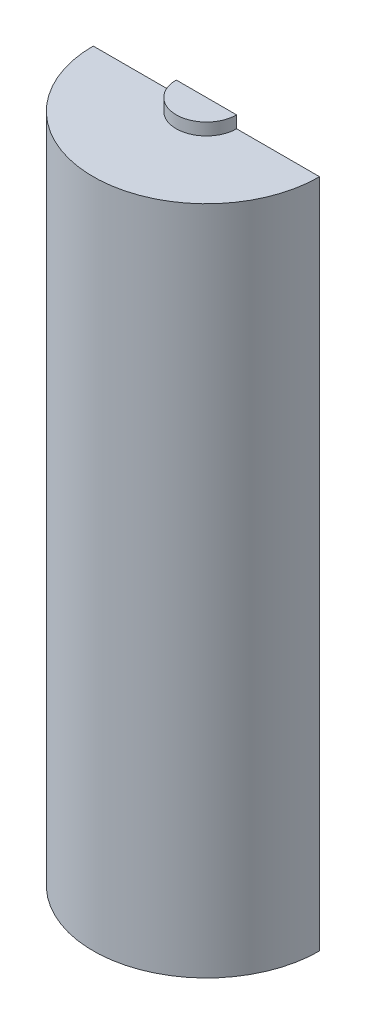
ISO-10303-21;
HEADER;
FILE_DESCRIPTION(('STEP AP214'),'2;1');
FILE_NAME('part.step','',(''),(''),'','','');
FILE_SCHEMA(('AUTOMOTIVE_DESIGN { 1 0 10303 214 1 1 1 1 }'));
ENDSEC;
DATA;
#1=APPLICATION_CONTEXT('core data for automotive mechanical design processes');
#2=APPLICATION_PROTOCOL_DEFINITION('international standard','automotive_design',2000,#1);
#3=PRODUCT_CONTEXT('',#1,'mechanical');
#4=PRODUCT('Part','Part','',(#3));
#5=PRODUCT_RELATED_PRODUCT_CATEGORY('part','',(#4));
#6=PRODUCT_DEFINITION_FORMATION('','',#4);
#7=PRODUCT_DEFINITION_CONTEXT('part definition',#1,'design');
#8=PRODUCT_DEFINITION('design','',#6,#7);
#9=PRODUCT_DEFINITION_SHAPE('','',#8);
#10=(LENGTH_UNIT() NAMED_UNIT(*) SI_UNIT(.MILLI.,.METRE.));
#11=(NAMED_UNIT(*) PLANE_ANGLE_UNIT() SI_UNIT($,.RADIAN.));
#12=(NAMED_UNIT(*) SI_UNIT($,.STERADIAN.) SOLID_ANGLE_UNIT());
#13=UNCERTAINTY_MEASURE_WITH_UNIT(LENGTH_MEASURE(1.E-05),#10,'distance_accuracy_value','');
#14=(GEOMETRIC_REPRESENTATION_CONTEXT(3) GLOBAL_UNCERTAINTY_ASSIGNED_CONTEXT((#13)) GLOBAL_UNIT_ASSIGNED_CONTEXT((#10,
#11,#12)) REPRESENTATION_CONTEXT('',''));
#15=CARTESIAN_POINT('',(0.,0.,0.));
#16=DIRECTION('',(0.,0.,1.));
#17=DIRECTION('',(1.,0.,0.));
#18=AXIS2_PLACEMENT_3D('',#15,#16,#17);
#19=CARTESIAN_POINT('',(0.,82.5881,0.));
#20=DIRECTION('',(0.,-1.,0.));
#21=DIRECTION('',(0.,0.,-1.));
#22=AXIS2_PLACEMENT_3D('',#19,#20,#21);
#23=CYLINDRICAL_SURFACE('',#22,12.2555);
#24=CARTESIAN_POINT('',(0.,67.8053,0.));
#25=DIRECTION('',(0.,-1.,0.));
#26=DIRECTION('',(-0.345087120666617,0.,0.938570657516004));
#27=AXIS2_PLACEMENT_3D('',#24,#25,#26);
#28=CIRCLE('',#27,12.2555);
#29=CARTESIAN_POINT('',(-2.96190447417867,67.8053,11.8921992135955));
#30=VERTEX_POINT('',#29);
#31=CARTESIAN_POINT('',(-4.22921520732972,67.8053,11.5026526931874));
#32=VERTEX_POINT('',#31);
#33=EDGE_CURVE('E278',#30,#32,#28,.T.);
#34=ORIENTED_EDGE('',*,*,#33,.F.);
#35=DIRECTION('',(0.,-1.,0.));
#36=VECTOR('',#35,1.);
#37=CARTESIAN_POINT('',(-2.96190447417867,71.6153,11.8921992135955));
#38=LINE('',#37,#36);
#39=CARTESIAN_POINT('',(-2.96190447417868,75.4253,11.8921992135955));
#40=VERTEX_POINT('',#39);
#41=EDGE_CURVE('E292',#30,#40,#38,.F.);
#42=ORIENTED_EDGE('',*,*,#41,.T.);
#43=CARTESIAN_POINT('',(0.,75.4253,0.));
#44=DIRECTION('',(0.,-1.,0.));
#45=DIRECTION('',(-0.364463857704521,0.,0.931217534428524));
#46=AXIS2_PLACEMENT_3D('',#43,#44,#45);
#47=CIRCLE('',#46,12.2555);
#48=CARTESIAN_POINT('',(-4.46668680809776,75.4253,11.4125364931888));
#49=VERTEX_POINT('',#48);
#50=EDGE_CURVE('E254',#40,#49,#47,.T.);
#51=ORIENTED_EDGE('',*,*,#50,.T.);
#52=DIRECTION('',(0.,-1.,0.));
#53=VECTOR('',#52,1.);
#54=CARTESIAN_POINT('',(-4.46668680809777,75.4253,11.4125364931888));
#55=LINE('',#54,#53);
#56=CARTESIAN_POINT('',(-4.46668680809777,71.3105,11.4125364931888));
#57=VERTEX_POINT('',#56);
#58=EDGE_CURVE('E258',#49,#57,#55,.T.);
#59=ORIENTED_EDGE('',*,*,#58,.T.);
#60=CARTESIAN_POINT('',(-4.22921520732972,67.8053,11.5026526931874));
#61=CARTESIAN_POINT('',(-4.30868085633509,68.9737000000346,11.4734353169701));
#62=CARTESIAN_POINT('',(-4.38784372351382,70.1420999999654,11.443394433142));
#63=CARTESIAN_POINT('',(-4.46668680809776,71.3105,11.4125364931888));
#64=B_SPLINE_CURVE_WITH_KNOTS('',3,(#60,#61,#62,#63),.UNSPECIFIED.,.F.,.F.,(4,4),(0.,1.),.UNSPECIFIED.);
#65=EDGE_CURVE('E282',#57,#32,#64,.F.);
#66=ORIENTED_EDGE('',*,*,#65,.T.);
#67=EDGE_LOOP('',(#34,#42,#51,#59,#66));
#68=FACE_BOUND('',#67,.T.);
#69=DIRECTION('',(0.,1.,0.));
#70=VECTOR('',#69,1.);
#71=CARTESIAN_POINT('',(4.46668680809776,71.3105,11.4125364931888));
#72=LINE('',#71,#70);
#73=CARTESIAN_POINT('',(4.46668680809776,71.3105,11.4125364931888));
#74=VERTEX_POINT('',#73);
#75=CARTESIAN_POINT('',(4.46668680809776,75.4253,11.4125364931888));
#76=VERTEX_POINT('',#75);
#77=EDGE_CURVE('E424',#74,#76,#72,.T.);
#78=ORIENTED_EDGE('',*,*,#77,.T.);
#79=CARTESIAN_POINT('',(0.,75.4253,0.));
#80=DIRECTION('',(0.,-1.,0.));
#81=DIRECTION('',(0.226009547016077,0.,0.974125086761237));
#82=AXIS2_PLACEMENT_3D('',#79,#80,#81);
#83=CIRCLE('',#82,12.2555);
#84=CARTESIAN_POINT('',(2.96190447417868,75.4253,11.8921992135955));
#85=VERTEX_POINT('',#84);
#86=EDGE_CURVE('E433',#76,#85,#83,.T.);
#87=ORIENTED_EDGE('',*,*,#86,.T.);
#88=DIRECTION('',(0.,-1.,0.));
#89=VECTOR('',#88,1.);
#90=CARTESIAN_POINT('',(2.96190447417868,71.6153,11.8921992135955));
#91=LINE('',#90,#89);
#92=CARTESIAN_POINT('',(2.96190447417868,67.8053,11.8921992135955));
#93=VERTEX_POINT('',#92);
#94=EDGE_CURVE('E294',#85,#93,#91,.T.);
#95=ORIENTED_EDGE('',*,*,#94,.T.);
#96=CARTESIAN_POINT('',(0.,67.8053,0.));
#97=DIRECTION('',(0.,-1.,0.));
#98=DIRECTION('',(0.226009547016077,0.,0.974125086761237));
#99=AXIS2_PLACEMENT_3D('',#96,#97,#98);
#100=CIRCLE('',#99,12.2555);
#101=CARTESIAN_POINT('',(4.22921520732972,67.8053,11.5026526931874));
#102=VERTEX_POINT('',#101);
#103=EDGE_CURVE('E426',#102,#93,#100,.T.);
#104=ORIENTED_EDGE('',*,*,#103,.F.);
#105=CARTESIAN_POINT('',(4.46668680809776,71.3105,11.4125364931888));
#106=CARTESIAN_POINT('',(4.38784372351381,70.1420999999654,11.443394433142));
#107=CARTESIAN_POINT('',(4.30868085633509,68.9737000000346,11.4734353169701));
#108=CARTESIAN_POINT('',(4.22921520732971,67.8053,11.5026526931874));
#109=B_SPLINE_CURVE_WITH_KNOTS('',3,(#105,#106,#107,#108),.UNSPECIFIED.,.F.,.F.,(4,4),(0.,1.),.UNSPECIFIED.);
#110=EDGE_CURVE('E408',#102,#74,#109,.F.);
#111=ORIENTED_EDGE('',*,*,#110,.T.);
#112=EDGE_LOOP('',(#78,#87,#95,#104,#111));
#113=FACE_BOUND('',#112,.T.);
#114=CARTESIAN_POINT('',(0.,0.,0.));
#115=DIRECTION('',(0.,-1.,0.));
#116=DIRECTION('',(0.,0.,1.));
#117=AXIS2_PLACEMENT_3D('',#114,#115,#116);
#118=CIRCLE('',#117,12.2555);
#119=CARTESIAN_POINT('',(12.2555,0.,0.));
#120=VERTEX_POINT('',#119);
#121=CARTESIAN_POINT('',(-12.2555,0.,0.));
#122=VERTEX_POINT('',#121);
#123=EDGE_CURVE('E448',#120,#122,#118,.T.);
#124=ORIENTED_EDGE('',*,*,#123,.T.);
#125=DIRECTION('',(0.,-1.,0.));
#126=VECTOR('',#125,1.);
#127=CARTESIAN_POINT('',(-12.2555,82.5881,0.));
#128=LINE('',#127,#126);
#129=CARTESIAN_POINT('',(-12.2555,82.5881,0.));
#130=VERTEX_POINT('',#129);
#131=EDGE_CURVE('E575',#130,#122,#128,.T.);
#132=ORIENTED_EDGE('',*,*,#131,.F.);
#133=CARTESIAN_POINT('',(0.,82.5881,0.));
#134=DIRECTION('',(0.,-1.,0.));
#135=DIRECTION('',(0.,0.,1.));
#136=AXIS2_PLACEMENT_3D('',#133,#134,#135);
#137=CIRCLE('',#136,12.2555);
#138=CARTESIAN_POINT('',(12.2555,82.5881,0.));
#139=VERTEX_POINT('',#138);
#140=EDGE_CURVE('E590',#139,#130,#137,.T.);
#141=ORIENTED_EDGE('',*,*,#140,.F.);
#142=DIRECTION('',(0.,-1.,0.));
#143=VECTOR('',#142,1.);
#144=CARTESIAN_POINT('',(12.2555,82.5881,0.));
#145=LINE('',#144,#143);
#146=EDGE_CURVE('E587',#139,#120,#145,.T.);
#147=ORIENTED_EDGE('',*,*,#146,.T.);
#148=EDGE_LOOP('',(#124,#132,#141,#147));
#149=FACE_BOUND('',#148,.T.);
#150=ADVANCED_FACE('F73',(#68,#113,#149),#23,.F.);
#151=CARTESIAN_POINT('',(0.,82.5881,0.));
#152=DIRECTION('',(0.,-1.,0.));
#153=DIRECTION('',(0.,0.,-1.));
#154=AXIS2_PLACEMENT_3D('',#151,#152,#153);
#155=CYLINDRICAL_SURFACE('',#154,14.2875);
#156=CARTESIAN_POINT('',(0.,0.,0.));
#157=DIRECTION('',(0.,1.,0.));
#158=DIRECTION('',(0.,0.,1.));
#159=AXIS2_PLACEMENT_3D('',#156,#157,#158);
#160=CIRCLE('',#159,14.2875);
#161=CARTESIAN_POINT('',(-14.2875,0.,0.));
#162=VERTEX_POINT('',#161);
#163=CARTESIAN_POINT('',(14.2875,0.,0.));
#164=VERTEX_POINT('',#163);
#165=EDGE_CURVE('E593',#162,#164,#160,.T.);
#166=ORIENTED_EDGE('',*,*,#165,.T.);
#167=DIRECTION('',(0.,-1.,0.));
#168=VECTOR('',#167,1.);
#169=CARTESIAN_POINT('',(14.2875,82.5881,0.));
#170=LINE('',#169,#168);
#171=CARTESIAN_POINT('',(14.2875,84.6201,0.));
#172=VERTEX_POINT('',#171);
#173=EDGE_CURVE('E582',#172,#164,#170,.T.);
#174=ORIENTED_EDGE('',*,*,#173,.F.);
#175=CARTESIAN_POINT('',(0.,84.6201,0.));
#176=DIRECTION('',(0.,1.,0.));
#177=DIRECTION('',(0.,0.,1.));
#178=AXIS2_PLACEMENT_3D('',#175,#176,#177);
#179=CIRCLE('',#178,14.2875);
#180=CARTESIAN_POINT('',(-14.2875,84.6201,0.));
#181=VERTEX_POINT('',#180);
#182=EDGE_CURVE('E248',#181,#172,#179,.T.);
#183=ORIENTED_EDGE('',*,*,#182,.F.);
#184=DIRECTION('',(0.,-1.,0.));
#185=VECTOR('',#184,1.);
#186=CARTESIAN_POINT('',(-14.2875,82.5881,0.));
#187=LINE('',#186,#185);
#188=EDGE_CURVE('E577',#181,#162,#187,.T.);
#189=ORIENTED_EDGE('',*,*,#188,.T.);
#190=EDGE_LOOP('',(#166,#174,#183,#189));
#191=FACE_BOUND('',#190,.T.);
#192=ADVANCED_FACE('F464',(#191),#155,.T.);
#193=CARTESIAN_POINT('',(12.2555,82.5881,0.));
#194=DIRECTION('',(0.,0.,1.));
#195=DIRECTION('',(1.,0.,0.));
#196=AXIS2_PLACEMENT_3D('',#193,#194,#195);
#197=PLANE('',#196);
#198=DIRECTION('',(1.,0.,0.));
#199=VECTOR('',#198,1.);
#200=CARTESIAN_POINT('',(3.175,83.6041,0.));
#201=LINE('',#200,#199);
#202=CARTESIAN_POINT('',(-3.175,83.6041,0.));
#203=VERTEX_POINT('',#202);
#204=CARTESIAN_POINT('',(3.175,83.6041,0.));
#205=VERTEX_POINT('',#204);
#206=EDGE_CURVE('E221',#203,#205,#201,.T.);
#207=ORIENTED_EDGE('',*,*,#206,.F.);
#208=DIRECTION('',(0.,-1.,0.));
#209=VECTOR('',#208,1.);
#210=CARTESIAN_POINT('',(-3.175,93.2436158285618,0.));
#211=LINE('',#210,#209);
#212=CARTESIAN_POINT('',(-3.175,82.5881,0.));
#213=VERTEX_POINT('',#212);
#214=EDGE_CURVE('E217',#203,#213,#211,.T.);
#215=ORIENTED_EDGE('',*,*,#214,.T.);
#216=DIRECTION('',(-1.,0.,0.));
#217=VECTOR('',#216,1.);
#218=CARTESIAN_POINT('',(12.2555,82.5881,0.));
#219=LINE('',#218,#217);
#220=EDGE_CURVE('E245',#213,#130,#219,.T.);
#221=ORIENTED_EDGE('',*,*,#220,.T.);
#222=ORIENTED_EDGE('',*,*,#131,.T.);
#223=DIRECTION('',(-1.,0.,0.));
#224=VECTOR('',#223,1.);
#225=CARTESIAN_POINT('',(-12.2555,0.,0.));
#226=LINE('',#225,#224);
#227=EDGE_CURVE('E595',#122,#162,#226,.T.);
#228=ORIENTED_EDGE('',*,*,#227,.T.);
#229=ORIENTED_EDGE('',*,*,#188,.F.);
#230=DIRECTION('',(-1.,0.,0.));
#231=VECTOR('',#230,1.);
#232=CARTESIAN_POINT('',(-12.2555,84.6201,0.));
#233=LINE('',#232,#231);
#234=CARTESIAN_POINT('',(-3.81,84.6201,0.));
#235=VERTEX_POINT('',#234);
#236=EDGE_CURVE('E249',#235,#181,#233,.T.);
#237=ORIENTED_EDGE('',*,*,#236,.F.);
#238=DIRECTION('',(0.,-1.,0.));
#239=VECTOR('',#238,1.);
#240=CARTESIAN_POINT('',(-3.81,86.1441,0.));
#241=LINE('',#240,#239);
#242=CARTESIAN_POINT('',(-3.81,86.1441,0.));
#243=VERTEX_POINT('',#242);
#244=EDGE_CURVE('E238',#243,#235,#241,.T.);
#245=ORIENTED_EDGE('',*,*,#244,.F.);
#246=DIRECTION('',(-1.,0.,0.));
#247=VECTOR('',#246,1.);
#248=CARTESIAN_POINT('',(3.81,86.1441,0.));
#249=LINE('',#248,#247);
#250=CARTESIAN_POINT('',(3.81,86.1441,0.));
#251=VERTEX_POINT('',#250);
#252=EDGE_CURVE('E236',#251,#243,#249,.T.);
#253=ORIENTED_EDGE('',*,*,#252,.F.);
#254=DIRECTION('',(0.,-1.,0.));
#255=VECTOR('',#254,1.);
#256=CARTESIAN_POINT('',(3.81,86.1441,0.));
#257=LINE('',#256,#255);
#258=CARTESIAN_POINT('',(3.81,84.6201,0.));
#259=VERTEX_POINT('',#258);
#260=EDGE_CURVE('E242',#251,#259,#257,.T.);
#261=ORIENTED_EDGE('',*,*,#260,.T.);
#262=EDGE_CURVE('E246',#172,#259,#233,.T.);
#263=ORIENTED_EDGE('',*,*,#262,.F.);
#264=ORIENTED_EDGE('',*,*,#173,.T.);
#265=DIRECTION('',(-1.,0.,0.));
#266=VECTOR('',#265,1.);
#267=CARTESIAN_POINT('',(12.2555,0.,0.));
#268=LINE('',#267,#266);
#269=EDGE_CURVE('E591',#164,#120,#268,.T.);
#270=ORIENTED_EDGE('',*,*,#269,.T.);
#271=ORIENTED_EDGE('',*,*,#146,.F.);
#272=CARTESIAN_POINT('',(3.175,82.5881,0.));
#273=VERTEX_POINT('',#272);
#274=EDGE_CURVE('E229',#139,#273,#219,.T.);
#275=ORIENTED_EDGE('',*,*,#274,.T.);
#276=DIRECTION('',(0.,-1.,0.));
#277=VECTOR('',#276,1.);
#278=CARTESIAN_POINT('',(3.175,93.2436158285618,0.));
#279=LINE('',#278,#277);
#280=EDGE_CURVE('E94',#205,#273,#279,.T.);
#281=ORIENTED_EDGE('',*,*,#280,.F.);
#282=EDGE_LOOP('',(#207,#215,#221,#222,#228,#229,#237,#245,#253,#261,#263,#264,#270,#271,#275,#281));
#283=FACE_BOUND('',#282,.T.);
#284=ADVANCED_FACE('F227',(#283),#197,.F.);
#285=CARTESIAN_POINT('',(0.,0.,0.));
#286=DIRECTION('',(0.,1.,0.));
#287=DIRECTION('',(0.,0.,1.));
#288=AXIS2_PLACEMENT_3D('',#285,#286,#287);
#289=PLANE('',#288);
#290=ORIENTED_EDGE('',*,*,#123,.F.);
#291=ORIENTED_EDGE('',*,*,#269,.F.);
#292=ORIENTED_EDGE('',*,*,#165,.F.);
#293=ORIENTED_EDGE('',*,*,#227,.F.);
#294=EDGE_LOOP('',(#290,#291,#292,#293));
#295=FACE_BOUND('',#294,.T.);
#296=ADVANCED_FACE('F462',(#295),#289,.F.);
#297=CARTESIAN_POINT('',(0.,75.4253,0.));
#298=DIRECTION('',(0.,1.,0.));
#299=DIRECTION('',(0.,0.,1.));
#300=AXIS2_PLACEMENT_3D('',#297,#298,#299);
#301=PLANE('',#300);
#302=DIRECTION('',(0.364463857704522,0.,0.931217534428523));
#303=VECTOR('',#302,1.);
#304=CARTESIAN_POINT('',(4.46668680809776,75.4253,11.4125364931888));
#305=LINE('',#304,#303);
#306=CARTESIAN_POINT('',(4.28053825333711,75.4253,10.9369206137613));
#307=VERTEX_POINT('',#306);
#308=EDGE_CURVE('E374',#307,#76,#305,.T.);
#309=ORIENTED_EDGE('',*,*,#308,.F.);
#310=CARTESIAN_POINT('',(4.04400899959226,75.4253,11.0294944336183));
#311=DIRECTION('',(0.,1.,0.));
#312=DIRECTION('',(0.,0.,1.));
#313=AXIS2_PLACEMENT_3D('',#310,#311,#312);
#314=CIRCLE('',#313,0.254);
#315=CARTESIAN_POINT('',(3.95657096716865,75.4253,10.7910188782968));
#316=VERTEX_POINT('',#315);
#317=EDGE_CURVE('E399',#307,#316,#314,.T.);
#318=ORIENTED_EDGE('',*,*,#317,.T.);
#319=CARTESIAN_POINT('',(0.,75.4253,0.));
#320=DIRECTION('',(0.,-1.,0.));
#321=DIRECTION('',(0.,0.,-1.));
#322=AXIS2_PLACEMENT_3D('',#319,#320,#321);
#323=CIRCLE('',#322,11.4935);
#324=CARTESIAN_POINT('',(3.49838746566874,75.4253,10.9481426456752));
#325=VERTEX_POINT('',#324);
#326=EDGE_CURVE('E409',#316,#325,#323,.T.);
#327=ORIENTED_EDGE('',*,*,#326,.T.);
#328=DIRECTION('',(0.494070124190426,0.,-0.869422056530922));
#329=VECTOR('',#328,1.);
#330=CARTESIAN_POINT('',(7.34724707517949,75.4253,4.17525095852289));
#331=LINE('',#330,#329);
#332=EDGE_CURVE('E290',#325,#85,#331,.F.);
#333=ORIENTED_EDGE('',*,*,#332,.T.);
#334=ORIENTED_EDGE('',*,*,#86,.F.);
#335=EDGE_LOOP('',(#309,#318,#327,#333,#334));
#336=FACE_BOUND('',#335,.T.);
#337=ADVANCED_FACE('F449',(#336),#301,.T.);
#338=CARTESIAN_POINT('',(0.,67.8053,0.));
#339=DIRECTION('',(0.,1.,0.));
#340=DIRECTION('',(0.,0.,1.));
#341=AXIS2_PLACEMENT_3D('',#338,#339,#340);
#342=PLANE('',#341);
#343=CARTESIAN_POINT('',(0.,67.8053,0.));
#344=DIRECTION('',(0.,-1.,0.));
#345=DIRECTION('',(0.,0.,-1.));
#346=AXIS2_PLACEMENT_3D('',#343,#344,#345);
#347=CIRCLE('',#346,11.4935);
#348=CARTESIAN_POINT('',(3.95657096716865,67.8053,10.7910188782968));
#349=VERTEX_POINT('',#348);
#350=CARTESIAN_POINT('',(3.49838746566874,67.8053,10.9481426456752));
#351=VERTEX_POINT('',#350);
#352=EDGE_CURVE('E404',#349,#351,#347,.T.);
#353=ORIENTED_EDGE('',*,*,#352,.F.);
#354=CARTESIAN_POINT('',(4.04400899959226,67.8053,11.0294944336183));
#355=DIRECTION('',(0.,1.,0.));
#356=DIRECTION('',(0.,0.,1.));
#357=AXIS2_PLACEMENT_3D('',#354,#355,#356);
#358=CIRCLE('',#357,0.254);
#359=CARTESIAN_POINT('',(3.96625882138175,67.8053,10.7874618521602));
#360=VERTEX_POINT('',#359);
#361=EDGE_CURVE('E87',#349,#360,#358,.F.);
#362=ORIENTED_EDGE('',*,*,#361,.T.);
#363=CARTESIAN_POINT('',(4.22921520732971,67.8053,11.5026526931874));
#364=CARTESIAN_POINT('',(3.96625882138175,67.8053,10.7874618521602));
#365=B_SPLINE_CURVE_WITH_KNOTS('',1,(#363,#364),.UNSPECIFIED.,.F.,.F.,(2,2),(0.,1.),.UNSPECIFIED.);
#366=EDGE_CURVE('E418',#360,#102,#365,.F.);
#367=ORIENTED_EDGE('',*,*,#366,.T.);
#368=ORIENTED_EDGE('',*,*,#103,.T.);
#369=DIRECTION('',(0.494070124190426,0.,-0.869422056530922));
#370=VECTOR('',#369,1.);
#371=CARTESIAN_POINT('',(7.34724707517949,67.8053,4.17525095852289));
#372=LINE('',#371,#370);
#373=EDGE_CURVE('E284',#93,#351,#372,.T.);
#374=ORIENTED_EDGE('',*,*,#373,.T.);
#375=EDGE_LOOP('',(#353,#362,#367,#368,#374));
#376=FACE_BOUND('',#375,.T.);
#377=ADVANCED_FACE('F348',(#376),#342,.F.);
#378=CARTESIAN_POINT('',(4.22921520732971,67.8053,11.5026526931874));
#379=CARTESIAN_POINT('',(4.30868085633509,68.9737000000346,11.4734353169701));
#380=CARTESIAN_POINT('',(4.38784372351381,70.1420999999654,11.443394433142));
#381=CARTESIAN_POINT('',(4.46668680809776,71.3105,11.4125364931888));
#382=CARTESIAN_POINT('',(3.96625882138175,67.8053,10.7874618521602));
#383=CARTESIAN_POINT('',(4.04078360101865,68.9737000000304,10.760061100371));
#384=CARTESIAN_POINT('',(4.11502442464275,70.1420999999696,10.7318880435165));
#385=CARTESIAN_POINT('',(4.18896534852692,71.3105,10.7029487319542));
#386=B_SPLINE_SURFACE_WITH_KNOTS('',1,3,((#378,#379,#380,#381),(#382,#383,#384,#385)),
.UNSPECIFIED.,.F.,.F.,.F.,(2,2),(4,4),(0.,1.),(0.,1.),.UNSPECIFIED.);
#387=CARTESIAN_POINT('',(3.96633280363914,67.8053,10.7876630696841));
#388=CARTESIAN_POINT('',(3.97180342752669,67.8897715929348,10.7859067400059));
#389=CARTESIAN_POINT('',(3.97734108300395,67.9742425144357,10.7843318537945));
#390=CARTESIAN_POINT('',(3.98855582152082,68.1431836127986,10.7815541455487));
#391=CARTESIAN_POINT('',(3.99423290850185,68.2276537895718,10.7803513340452));
#392=CARTESIAN_POINT('',(4.01148145843909,68.4810652239989,10.7773148129403));
#393=CARTESIAN_POINT('',(4.02326967411672,68.6499990890444,10.7760531910558));
#394=CARTESIAN_POINT('',(4.04750336395236,68.9878224042843,10.775228464415));
#395=CARTESIAN_POINT('',(4.05994882894942,69.1567118550648,10.7756653359906));
#396=CARTESIAN_POINT('',(4.08542531362013,69.491469365979,10.778571786295));
#397=CARTESIAN_POINT('',(4.09844234457137,69.6573387752599,10.7810057991785));
#398=CARTESIAN_POINT('',(4.12552233883116,69.9889283844303,10.7885114156823));
#399=CARTESIAN_POINT('',(4.13958522417768,70.1546485945114,10.7935828228695));
#400=CARTESIAN_POINT('',(4.16442897214561,70.4305806143442,10.8055805558628));
#401=CARTESIAN_POINT('',(4.17474133439333,70.5408821820957,10.8113251157368));
#402=CARTESIAN_POINT('',(4.19303782046983,70.7250032461337,10.823616892811));
#403=CARTESIAN_POINT('',(4.20067495411691,70.7989124143349,10.8292815722621));
#404=CARTESIAN_POINT('',(4.21427127958602,70.9222554910508,10.8408709346398));
#405=CARTESIAN_POINT('',(4.21996125313119,70.9717806064576,10.8461033553152));
#406=CARTESIAN_POINT('',(4.2301379517111,71.0543995241982,10.8565584717095));
#407=CARTESIAN_POINT('',(4.23441211008991,71.0875858565616,10.8612280968314));
#408=CARTESIAN_POINT('',(4.24209975174381,71.1429130195844,10.8704357174331));
#409=CARTESIAN_POINT('',(4.24534335512664,71.165148525342,10.8745260796067));
#410=CARTESIAN_POINT('',(4.25121623777569,71.2021818207479,10.8825336583688));
#411=CARTESIAN_POINT('',(4.25370854912316,71.2170762194599,10.8860850768846));
#412=CARTESIAN_POINT('',(4.25825643872916,71.2418331904195,10.8930193390113));
#413=CARTESIAN_POINT('',(4.26020086779721,71.2517974290522,10.8961003029214));
#414=CARTESIAN_POINT('',(4.26378171342848,71.2683102049792,10.9021197501975));
#415=CARTESIAN_POINT('',(4.26532772668797,71.2749630343504,10.9048082380569));
#416=CARTESIAN_POINT('',(4.26790366446079,71.2847433289372,10.9095339280068));
#417=CARTESIAN_POINT('',(4.26882851462635,71.2880401936604,10.9112711107215));
#418=CARTESIAN_POINT('',(4.27079282601073,71.2943902139074,10.9150840923594));
#419=CARTESIAN_POINT('',(4.27183185238722,71.2974442226257,10.9171586200605));
#420=CARTESIAN_POINT('',(4.2738652465403,71.3025174763108,10.9213897101295));
#421=CARTESIAN_POINT('',(4.27482922117,71.3046225447872,10.9234523993235));
#422=CARTESIAN_POINT('',(4.27675587272721,71.3078397006604,10.927763007404));
#423=CARTESIAN_POINT('',(4.27769564465801,71.3090550647134,10.9299328074676));
#424=CARTESIAN_POINT('',(4.2792775991683,71.3102500446662,10.9337472309007));
#425=CARTESIAN_POINT('',(4.27990971489924,71.3105123156392,10.9353123478239));
#426=CARTESIAN_POINT('',(4.28053825333685,71.3105,10.9369206137607));
#427=B_SPLINE_CURVE_WITH_KNOTS('',3,(#387,#388,#389,#390,#391,#392,#393,#394,#395,#396,#397,
#398,#399,#400,#401,#402,#403,#404,#405,#406,#407,#408,#409,#410,#411,#412,#413,#414,#415,#416,
#417,#418,#419,#420,#421,#422,#423,#424,#425,#426),.UNSPECIFIED.,.F.,.F.,(4,2,2,2,2,2,2,2,2,2,2,
2,2,2,2,2,2,2,2,4),(0.,0.253999864260978,0.508006916800958,1.016045968436,1.52407794073495,
2.02325416267699,2.52239321131951,2.85515543336202,3.07868116030382,3.22902817871849,
3.33035498972317,3.39884901731142,3.44535917653235,3.47716050414468,3.49913795733119,
3.51064396120591,3.52210757096569,3.53134877218029,3.53915924517962,3.54425567077091),.UNSPECIFIED.);
#428=CARTESIAN_POINT('',(4.28053825333711,71.3105,10.9369206137613));
#429=VERTEX_POINT('',#428);
#430=EDGE_CURVE('E13',#360,#429,#427,.T.);
#431=CARTESIAN_POINT('',(4.18896534852692,71.3105,10.7029487319542));
#432=CARTESIAN_POINT('',(4.46668680809776,71.3105,11.4125364931888));
#433=B_SPLINE_CURVE_WITH_KNOTS('',1,(#431,#432),.UNSPECIFIED.,.F.,.F.,(2,2),(0.,1.),.UNSPECIFIED.);
#434=EDGE_CURVE('E389',#429,#74,#433,.T.);
#435=ORIENTED_EDGE('',*,*,#366,.F.);
#436=ORIENTED_EDGE('',*,*,#430,.T.);
#437=ORIENTED_EDGE('',*,*,#434,.T.);
#438=ORIENTED_EDGE('',*,*,#110,.F.);
#439=EDGE_LOOP('',(#435,#436,#437,#438));
#440=FACE_BOUND('',#439,.T.);
#441=ADVANCED_FACE('F342',(#440),#386,.T.);
#442=CARTESIAN_POINT('',(4.46668680809776,73.3679,11.4125364931888));
#443=DIRECTION('',(0.931217534428523,0.,-0.364463857704521));
#444=DIRECTION('',(0.,1.,0.));
#445=AXIS2_PLACEMENT_3D('',#442,#443,#444);
#446=PLANE('',#445);
#447=ORIENTED_EDGE('',*,*,#434,.F.);
#448=DIRECTION('',(0.,1.,0.));
#449=VECTOR('',#448,1.);
#450=CARTESIAN_POINT('',(4.28053825333711,75.4253,10.9369206137613));
#451=LINE('',#450,#449);
#452=EDGE_CURVE('E397',#429,#307,#451,.T.);
#453=ORIENTED_EDGE('',*,*,#452,.T.);
#454=ORIENTED_EDGE('',*,*,#308,.T.);
#455=ORIENTED_EDGE('',*,*,#77,.F.);
#456=EDGE_LOOP('',(#447,#453,#454,#455));
#457=FACE_BOUND('',#456,.T.);
#458=ADVANCED_FACE('F340',(#457),#446,.T.);
#459=CARTESIAN_POINT('',(0.,82.5881,0.));
#460=DIRECTION('',(0.,-1.,0.));
#461=DIRECTION('',(0.,0.,-1.));
#462=AXIS2_PLACEMENT_3D('',#459,#460,#461);
#463=CYLINDRICAL_SURFACE('',#462,11.4935);
#464=ORIENTED_EDGE('',*,*,#326,.F.);
#465=DIRECTION('',(0.,-1.,0.));
#466=VECTOR('',#465,1.);
#467=CARTESIAN_POINT('',(3.95657096716865,82.5881,10.7910188782968));
#468=LINE('',#467,#466);
#469=EDGE_CURVE('E403',#316,#349,#468,.T.);
#470=ORIENTED_EDGE('',*,*,#469,.T.);
#471=ORIENTED_EDGE('',*,*,#352,.T.);
#472=DIRECTION('',(0.,-1.,0.));
#473=VECTOR('',#472,1.);
#474=CARTESIAN_POINT('',(3.49838746566874,82.5881,10.9481426456752));
#475=LINE('',#474,#473);
#476=EDGE_CURVE('E287',#351,#325,#475,.F.);
#477=ORIENTED_EDGE('',*,*,#476,.T.);
#478=EDGE_LOOP('',(#464,#470,#471,#477));
#479=FACE_BOUND('',#478,.T.);
#480=ADVANCED_FACE('F329',(#479),#463,.F.);
#481=CARTESIAN_POINT('',(-4.46668680809777,73.3679,11.4125364931888));
#482=DIRECTION('',(-0.931217534428523,0.,-0.364463857704522));
#483=DIRECTION('',(0.,-1.,0.));
#484=AXIS2_PLACEMENT_3D('',#481,#482,#483);
#485=PLANE('',#484);
#486=DIRECTION('',(-0.364463857704521,0.,0.931217534428524));
#487=VECTOR('',#486,1.);
#488=CARTESIAN_POINT('',(-4.46668680809776,75.4253,11.4125364931888));
#489=LINE('',#488,#487);
#490=CARTESIAN_POINT('',(-4.2805382533371,75.4253,10.9369206137613));
#491=VERTEX_POINT('',#490);
#492=EDGE_CURVE('E561',#491,#49,#489,.T.);
#493=ORIENTED_EDGE('',*,*,#492,.F.);
#494=DIRECTION('',(0.,1.,0.));
#495=VECTOR('',#494,1.);
#496=CARTESIAN_POINT('',(-4.28053825333711,71.3105,10.9369206137613));
#497=LINE('',#496,#495);
#498=CARTESIAN_POINT('',(-4.28053825333711,71.3105,10.9369206137613));
#499=VERTEX_POINT('',#498);
#500=EDGE_CURVE('E296',#491,#499,#497,.F.);
#501=ORIENTED_EDGE('',*,*,#500,.T.);
#502=CARTESIAN_POINT('',(-4.46668680809776,71.3105,11.4125364931888));
#503=CARTESIAN_POINT('',(-4.18896534852692,71.3105,10.7029487319542));
#504=B_SPLINE_CURVE_WITH_KNOTS('',1,(#502,#503),.UNSPECIFIED.,.F.,.F.,(2,2),(0.,1.),.UNSPECIFIED.);
#505=EDGE_CURVE('E303',#499,#57,#504,.F.);
#506=ORIENTED_EDGE('',*,*,#505,.T.);
#507=ORIENTED_EDGE('',*,*,#58,.F.);
#508=EDGE_LOOP('',(#493,#501,#506,#507));
#509=FACE_BOUND('',#508,.T.);
#510=ADVANCED_FACE('F319',(#509),#485,.T.);
#511=CARTESIAN_POINT('',(-4.46668680809776,71.3105,11.4125364931888));
#512=CARTESIAN_POINT('',(-4.38784372351382,70.1420999999654,11.443394433142));
#513=CARTESIAN_POINT('',(-4.30868085633509,68.9737000000346,11.4734353169701));
#514=CARTESIAN_POINT('',(-4.22921520732972,67.8053,11.5026526931874));
#515=CARTESIAN_POINT('',(-4.18896534852692,71.3105,10.7029487319542));
#516=CARTESIAN_POINT('',(-4.11502442464275,70.1420999999696,10.7318880435165));
#517=CARTESIAN_POINT('',(-4.04078360101865,68.9737000000304,10.760061100371));
#518=CARTESIAN_POINT('',(-3.96625882138176,67.8053,10.7874618521602));
#519=B_SPLINE_SURFACE_WITH_KNOTS('',1,3,((#511,#512,#513,#514),(#515,#516,#517,#518)),
.UNSPECIFIED.,.F.,.F.,.F.,(2,2),(4,4),(0.,1.),(0.,1.),.UNSPECIFIED.);
#520=CARTESIAN_POINT('',(-4.28053825333711,71.3105,10.9369206137613));
#521=CARTESIAN_POINT('',(-4.27973459398731,71.3105103000626,10.9348653095897));
#522=CARTESIAN_POINT('',(-4.27893390382239,71.3100880284875,10.9328999492767));
#523=CARTESIAN_POINT('',(-4.27712280621244,71.3083972513024,10.928594400074));
#524=CARTESIAN_POINT('',(-4.27612590963852,71.3069038394157,10.9263315142853));
#525=CARTESIAN_POINT('',(-4.27433957216803,71.3035549400779,10.9224043468043));
#526=CARTESIAN_POINT('',(-4.273540001952,71.3017369289783,10.920707080262));
#527=CARTESIAN_POINT('',(-4.2720171624267,71.2978687331076,10.9175513816666));
#528=CARTESIAN_POINT('',(-4.27129407662263,71.295818013376,10.9160935195769));
#529=CARTESIAN_POINT('',(-4.26940775788629,71.2900560815583,10.9123683712578));
#530=CARTESIAN_POINT('',(-4.26830392379631,71.2862155441867,10.9102771815953));
#531=CARTESIAN_POINT('',(-4.26621097591962,71.2783540317608,10.9064215333839));
#532=CARTESIAN_POINT('',(-4.2652218379722,71.274333094956,10.9046570059766));
#533=CARTESIAN_POINT('',(-4.26236029476962,71.2620623663536,10.899672518358));
#534=CARTESIAN_POINT('',(-4.26060704868202,71.253651012535,10.8967868016331));
#535=CARTESIAN_POINT('',(-4.25695824907305,71.235006944802,10.890994819527));
#536=CARTESIAN_POINT('',(-4.25510082282006,71.224736786604,10.8881926630762));
#537=CARTESIAN_POINT('',(-4.25154691100141,71.2040580716402,10.8830234723008));
#538=CARTESIAN_POINT('',(-4.24985048010167,71.1936494692237,10.8806565855178));
#539=CARTESIAN_POINT('',(-4.24492132735188,71.1622689943602,10.8739913413409));
#540=CARTESIAN_POINT('',(-4.24185522442257,71.1411782505607,10.8701381771167));
#541=CARTESIAN_POINT('',(-4.23598506493023,71.0988808703917,10.8631167746496));
#542=CARTESIAN_POINT('',(-4.23318069037587,71.0776744086847,10.8599476989464));
#543=CARTESIAN_POINT('',(-4.22775440669632,71.0351990356643,10.8540819848737));
#544=CARTESIAN_POINT('',(-4.22513228940825,71.0139302255035,10.8513848020101));
#545=CARTESIAN_POINT('',(-4.21749442036399,70.9503221197441,10.8438325140418));
#546=CARTESIAN_POINT('',(-4.21267000436544,70.9079016688172,10.8394744457538));
#547=CARTESIAN_POINT('',(-4.2033464223895,70.8229458047749,10.8315955752321));
#548=CARTESIAN_POINT('',(-4.19884729985402,70.7804103770886,10.8280748846844));
#549=CARTESIAN_POINT('',(-4.18569065913657,70.6526365162313,10.8183956476761));
#550=CARTESIAN_POINT('',(-4.17738128715203,70.5672954609759,10.8131266849481));
#551=CARTESIAN_POINT('',(-4.16133828496914,70.3965555516524,10.8040333414713));
#552=CARTESIAN_POINT('',(-4.1536042184171,70.3111567920031,10.8002078567259));
#553=CARTESIAN_POINT('',(-4.13855267953104,70.1403121176081,10.7936022169963));
#554=CARTESIAN_POINT('',(-4.13123506539958,70.0548662290361,10.7908217043817));
#555=CARTESIAN_POINT('',(-4.11653781887331,69.8793610669068,10.7859405357091));
#556=CARTESIAN_POINT('',(-4.10917574862538,69.7892991384941,10.7838841227083));
#557=CARTESIAN_POINT('',(-4.09474051963525,69.6091300198508,10.7805022868008));
#558=CARTESIAN_POINT('',(-4.08766738920297,69.5190228260565,10.7791769353643));
#559=CARTESIAN_POINT('',(-4.06681495807302,69.2486786397035,10.7761287786672));
#560=CARTESIAN_POINT('',(-4.05340127583652,69.0684027969524,10.7753334646538));
#561=CARTESIAN_POINT('',(-4.02732673383619,68.7076666693317,10.7757077124139));
#562=CARTESIAN_POINT('',(-4.01466644090439,68.5272063469512,10.7768787347326));
#563=CARTESIAN_POINT('',(-3.9900182858719,68.1662642915297,10.7809918172383));
#564=CARTESIAN_POINT('',(-3.97803040633024,67.9857825591657,10.7839338314663));
#565=CARTESIAN_POINT('',(-3.96633280363915,67.8053,10.7876630696841));
#566=B_SPLINE_CURVE_WITH_KNOTS('',3,(#520,#521,#522,#523,#524,#525,#526,#527,#528,#529,#530,
#531,#532,#533,#534,#535,#536,#537,#538,#539,#540,#541,#542,#543,#544,#545,#546,#547,#548,#549,
#550,#551,#552,#553,#554,#555,#556,#557,#558,#559,#560,#561,#562,#563,#564,#565),.UNSPECIFIED.,
.F.,.F.,(4,2,2,2,2,2,2,2,2,2,2,2,2,2,2,2,2,2,2,2,2,2,4),(0.,0.00644799738421514,
0.0149298092271257,0.022747923788853,0.0305843896745997,0.0440820519889287,0.057576865838048,
0.0847285035433759,0.117134908614488,0.149552278192797,0.214499787465552,0.279367331426536,
0.344159527081257,0.472889220050553,0.601636072831889,0.859326862059285,1.11682016354053,
1.37422526031299,1.64537840287502,1.91655804922867,2.45886843047822,3.00158180444321,
3.54428109506087),.UNSPECIFIED.);
#567=CARTESIAN_POINT('',(-3.96625882138176,67.8053,10.7874618521602));
#568=VERTEX_POINT('',#567);
#569=EDGE_CURVE('E531',#499,#568,#566,.T.);
#570=CARTESIAN_POINT('',(-3.96625882138176,67.8053,10.7874618521602));
#571=CARTESIAN_POINT('',(-4.22921520732972,67.8053,11.5026526931874));
#572=B_SPLINE_CURVE_WITH_KNOTS('',1,(#570,#571),.UNSPECIFIED.,.F.,.F.,(2,2),(0.,1.),.UNSPECIFIED.);
#573=EDGE_CURVE('E281',#568,#32,#572,.T.);
#574=ORIENTED_EDGE('',*,*,#505,.F.);
#575=ORIENTED_EDGE('',*,*,#569,.T.);
#576=ORIENTED_EDGE('',*,*,#573,.T.);
#577=ORIENTED_EDGE('',*,*,#65,.F.);
#578=EDGE_LOOP('',(#574,#575,#576,#577));
#579=FACE_BOUND('',#578,.T.);
#580=ADVANCED_FACE('F328',(#579),#519,.T.);
#581=CARTESIAN_POINT('',(0.,67.8053,0.));
#582=DIRECTION('',(0.,1.,0.));
#583=DIRECTION('',(0.,0.,1.));
#584=AXIS2_PLACEMENT_3D('',#581,#582,#583);
#585=PLANE('',#584);
#586=ORIENTED_EDGE('',*,*,#573,.F.);
#587=CARTESIAN_POINT('',(-4.04400899959227,67.8053,11.0294944336183));
#588=DIRECTION('',(0.,1.,0.));
#589=DIRECTION('',(0.,0.,1.));
#590=AXIS2_PLACEMENT_3D('',#587,#588,#589);
#591=CIRCLE('',#590,0.254);
#592=CARTESIAN_POINT('',(-3.95657096716865,67.8053,10.7910188782968));
#593=VERTEX_POINT('',#592);
#594=EDGE_CURVE('E525',#568,#593,#591,.F.);
#595=ORIENTED_EDGE('',*,*,#594,.T.);
#596=CARTESIAN_POINT('',(0.,67.8053,0.));
#597=DIRECTION('',(0.,-1.,0.));
#598=DIRECTION('',(0.,0.,-1.));
#599=AXIS2_PLACEMENT_3D('',#596,#597,#598);
#600=CIRCLE('',#599,11.4935);
#601=CARTESIAN_POINT('',(-3.49838746566874,67.8053,10.9481426456752));
#602=VERTEX_POINT('',#601);
#603=EDGE_CURVE('E259',#602,#593,#600,.T.);
#604=ORIENTED_EDGE('',*,*,#603,.F.);
#605=DIRECTION('',(-0.494070124190427,0.,-0.869422056530921));
#606=VECTOR('',#605,1.);
#607=CARTESIAN_POINT('',(-7.34724707517949,67.8053,4.1752509585229));
#608=LINE('',#607,#606);
#609=EDGE_CURVE('E277',#602,#30,#608,.F.);
#610=ORIENTED_EDGE('',*,*,#609,.T.);
#611=ORIENTED_EDGE('',*,*,#33,.T.);
#612=EDGE_LOOP('',(#586,#595,#604,#610,#611));
#613=FACE_BOUND('',#612,.T.);
#614=ADVANCED_FACE('F337',(#613),#585,.F.);
#615=CARTESIAN_POINT('',(0.,75.4253,0.));
#616=DIRECTION('',(0.,1.,0.));
#617=DIRECTION('',(0.,0.,1.));
#618=AXIS2_PLACEMENT_3D('',#615,#616,#617);
#619=PLANE('',#618);
#620=CARTESIAN_POINT('',(0.,75.4253,0.));
#621=DIRECTION('',(0.,-1.,0.));
#622=DIRECTION('',(0.,0.,-1.));
#623=AXIS2_PLACEMENT_3D('',#620,#621,#622);
#624=CIRCLE('',#623,11.4935);
#625=CARTESIAN_POINT('',(-3.49838746566874,75.4253,10.9481426456752));
#626=VERTEX_POINT('',#625);
#627=CARTESIAN_POINT('',(-3.95657096716865,75.4253,10.7910188782968));
#628=VERTEX_POINT('',#627);
#629=EDGE_CURVE('E252',#626,#628,#624,.T.);
#630=ORIENTED_EDGE('',*,*,#629,.T.);
#631=CARTESIAN_POINT('',(-4.04400899959227,75.4253,11.0294944336183));
#632=DIRECTION('',(0.,1.,0.));
#633=DIRECTION('',(0.,0.,1.));
#634=AXIS2_PLACEMENT_3D('',#631,#632,#633);
#635=CIRCLE('',#634,0.254);
#636=EDGE_CURVE('E391',#628,#491,#635,.T.);
#637=ORIENTED_EDGE('',*,*,#636,.T.);
#638=ORIENTED_EDGE('',*,*,#492,.T.);
#639=ORIENTED_EDGE('',*,*,#50,.F.);
#640=DIRECTION('',(-0.494070124190427,0.,-0.869422056530921));
#641=VECTOR('',#640,1.);
#642=CARTESIAN_POINT('',(-7.34724707517949,75.4253,4.1752509585229));
#643=LINE('',#642,#641);
#644=EDGE_CURVE('E272',#40,#626,#643,.T.);
#645=ORIENTED_EDGE('',*,*,#644,.T.);
#646=EDGE_LOOP('',(#630,#637,#638,#639,#645));
#647=FACE_BOUND('',#646,.T.);
#648=ADVANCED_FACE('F333',(#647),#619,.T.);
#649=CARTESIAN_POINT('',(0.,82.5881,0.));
#650=DIRECTION('',(0.,-1.,0.));
#651=DIRECTION('',(0.,0.,-1.));
#652=AXIS2_PLACEMENT_3D('',#649,#650,#651);
#653=CYLINDRICAL_SURFACE('',#652,11.4935);
#654=ORIENTED_EDGE('',*,*,#603,.T.);
#655=DIRECTION('',(0.,-1.,0.));
#656=VECTOR('',#655,1.);
#657=CARTESIAN_POINT('',(-3.95657096716865,82.5881,10.7910188782968));
#658=LINE('',#657,#656);
#659=EDGE_CURVE('E532',#593,#628,#658,.F.);
#660=ORIENTED_EDGE('',*,*,#659,.T.);
#661=ORIENTED_EDGE('',*,*,#629,.F.);
#662=DIRECTION('',(0.,-1.,0.));
#663=VECTOR('',#662,1.);
#664=CARTESIAN_POINT('',(-3.49838746566874,82.5881,10.9481426456752));
#665=LINE('',#664,#663);
#666=EDGE_CURVE('E274',#626,#602,#665,.T.);
#667=ORIENTED_EDGE('',*,*,#666,.T.);
#668=EDGE_LOOP('',(#654,#660,#661,#667));
#669=FACE_BOUND('',#668,.T.);
#670=ADVANCED_FACE('F336',(#669),#653,.F.);
#671=CARTESIAN_POINT('',(-2.81792609824142,82.5881,12.1455599605309));
#672=DIRECTION('',(0.869422056530921,0.,-0.494070124190427));
#673=DIRECTION('',(0.,-1.,0.));
#674=AXIS2_PLACEMENT_3D('',#671,#672,#673);
#675=PLANE('',#674);
#676=ORIENTED_EDGE('',*,*,#609,.F.);
#677=ORIENTED_EDGE('',*,*,#666,.F.);
#678=ORIENTED_EDGE('',*,*,#644,.F.);
#679=ORIENTED_EDGE('',*,*,#41,.F.);
#680=EDGE_LOOP('',(#676,#677,#678,#679));
#681=FACE_BOUND('',#680,.T.);
#682=ADVANCED_FACE('F476',(#681),#675,.T.);
#683=CARTESIAN_POINT('',(2.81792609824142,82.5881,12.1455599605309));
#684=DIRECTION('',(0.869422056530922,0.,0.494070124190426));
#685=DIRECTION('',(0.,-1.,0.));
#686=AXIS2_PLACEMENT_3D('',#683,#684,#685);
#687=PLANE('',#686);
#688=ORIENTED_EDGE('',*,*,#332,.F.);
#689=ORIENTED_EDGE('',*,*,#476,.F.);
#690=ORIENTED_EDGE('',*,*,#373,.F.);
#691=ORIENTED_EDGE('',*,*,#94,.F.);
#692=EDGE_LOOP('',(#688,#689,#690,#691));
#693=FACE_BOUND('',#692,.T.);
#694=ADVANCED_FACE('F454',(#693),#687,.F.);
#695=CARTESIAN_POINT('',(-4.04400899959227,82.5881,11.0294944336183));
#696=DIRECTION('',(0.,-1.,0.));
#697=DIRECTION('',(0.,0.,-1.));
#698=AXIS2_PLACEMENT_3D('',#695,#696,#697);
#699=CYLINDRICAL_SURFACE('',#698,0.254);
#700=ORIENTED_EDGE('',*,*,#636,.F.);
#701=ORIENTED_EDGE('',*,*,#659,.F.);
#702=ORIENTED_EDGE('',*,*,#594,.F.);
#703=ORIENTED_EDGE('',*,*,#569,.F.);
#704=ORIENTED_EDGE('',*,*,#500,.F.);
#705=EDGE_LOOP('',(#700,#701,#702,#703,#704));
#706=FACE_BOUND('',#705,.T.);
#707=ADVANCED_FACE('F529',(#706),#699,.T.);
#708=CARTESIAN_POINT('',(4.04400899959226,82.5881,11.0294944336183));
#709=DIRECTION('',(0.,-1.,0.));
#710=DIRECTION('',(0.,0.,-1.));
#711=AXIS2_PLACEMENT_3D('',#708,#709,#710);
#712=CYLINDRICAL_SURFACE('',#711,0.254);
#713=ORIENTED_EDGE('',*,*,#361,.F.);
#714=ORIENTED_EDGE('',*,*,#469,.F.);
#715=ORIENTED_EDGE('',*,*,#317,.F.);
#716=ORIENTED_EDGE('',*,*,#452,.F.);
#717=ORIENTED_EDGE('',*,*,#430,.F.);
#718=EDGE_LOOP('',(#713,#714,#715,#716,#717));
#719=FACE_BOUND('',#718,.T.);
#720=ADVANCED_FACE('F75',(#719),#712,.T.);
#721=CARTESIAN_POINT('',(0.,82.5881,0.));
#722=DIRECTION('',(0.,1.,0.));
#723=DIRECTION('',(0.,0.,1.));
#724=AXIS2_PLACEMENT_3D('',#721,#722,#723);
#725=PLANE('',#724);
#726=ORIENTED_EDGE('',*,*,#220,.F.);
#727=CARTESIAN_POINT('',(0.,82.5881,0.));
#728=DIRECTION('',(0.,-1.,0.));
#729=DIRECTION('',(0.,0.,-1.));
#730=AXIS2_PLACEMENT_3D('',#727,#728,#729);
#731=CIRCLE('',#730,3.175);
#732=EDGE_CURVE('E224',#273,#213,#731,.T.);
#733=ORIENTED_EDGE('',*,*,#732,.F.);
#734=ORIENTED_EDGE('',*,*,#274,.F.);
#735=ORIENTED_EDGE('',*,*,#140,.T.);
#736=EDGE_LOOP('',(#726,#733,#734,#735));
#737=FACE_BOUND('',#736,.T.);
#738=ADVANCED_FACE('F601',(#737),#725,.F.);
#739=CARTESIAN_POINT('',(0.,84.6201,0.));
#740=DIRECTION('',(0.,1.,0.));
#741=DIRECTION('',(0.,0.,1.));
#742=AXIS2_PLACEMENT_3D('',#739,#740,#741);
#743=PLANE('',#742);
#744=CARTESIAN_POINT('',(0.,84.6201,0.));
#745=DIRECTION('',(0.,1.,0.));
#746=DIRECTION('',(0.,0.,1.));
#747=AXIS2_PLACEMENT_3D('',#744,#745,#746);
#748=CIRCLE('',#747,3.81);
#749=EDGE_CURVE('E102',#235,#259,#748,.T.);
#750=ORIENTED_EDGE('',*,*,#749,.F.);
#751=ORIENTED_EDGE('',*,*,#236,.T.);
#752=ORIENTED_EDGE('',*,*,#182,.T.);
#753=ORIENTED_EDGE('',*,*,#262,.T.);
#754=EDGE_LOOP('',(#750,#751,#752,#753));
#755=FACE_BOUND('',#754,.T.);
#756=ADVANCED_FACE('F609',(#755),#743,.T.);
#757=CARTESIAN_POINT('',(0.,86.1441,0.));
#758=DIRECTION('',(0.,-1.,0.));
#759=DIRECTION('',(0.,0.,-1.));
#760=AXIS2_PLACEMENT_3D('',#757,#758,#759);
#761=CYLINDRICAL_SURFACE('',#760,3.81);
#762=ORIENTED_EDGE('',*,*,#749,.T.);
#763=ORIENTED_EDGE('',*,*,#260,.F.);
#764=CARTESIAN_POINT('',(0.,86.1441,0.));
#765=DIRECTION('',(0.,1.,0.));
#766=DIRECTION('',(0.,0.,1.));
#767=AXIS2_PLACEMENT_3D('',#764,#765,#766);
#768=CIRCLE('',#767,3.81);
#769=EDGE_CURVE('E233',#243,#251,#768,.T.);
#770=ORIENTED_EDGE('',*,*,#769,.F.);
#771=ORIENTED_EDGE('',*,*,#244,.T.);
#772=EDGE_LOOP('',(#762,#763,#770,#771));
#773=FACE_BOUND('',#772,.T.);
#774=ADVANCED_FACE('F613',(#773),#761,.T.);
#775=CARTESIAN_POINT('',(0.,86.1441,0.));
#776=DIRECTION('',(0.,1.,0.));
#777=DIRECTION('',(0.,0.,1.));
#778=AXIS2_PLACEMENT_3D('',#775,#776,#777);
#779=PLANE('',#778);
#780=ORIENTED_EDGE('',*,*,#769,.T.);
#781=ORIENTED_EDGE('',*,*,#252,.T.);
#782=EDGE_LOOP('',(#780,#781));
#783=FACE_BOUND('',#782,.T.);
#784=ADVANCED_FACE('F616',(#783),#779,.T.);
#785=CARTESIAN_POINT('',(0.,83.6041,0.));
#786=DIRECTION('',(0.,1.,0.));
#787=DIRECTION('',(0.,0.,1.));
#788=AXIS2_PLACEMENT_3D('',#785,#786,#787);
#789=PLANE('',#788);
#790=CARTESIAN_POINT('',(0.,83.6041,0.));
#791=DIRECTION('',(0.,1.,0.));
#792=DIRECTION('',(0.,0.,1.));
#793=AXIS2_PLACEMENT_3D('',#790,#791,#792);
#794=CIRCLE('',#793,3.175);
#795=EDGE_CURVE('E213',#205,#203,#794,.F.);
#796=ORIENTED_EDGE('',*,*,#795,.T.);
#797=ORIENTED_EDGE('',*,*,#206,.T.);
#798=EDGE_LOOP('',(#796,#797));
#799=FACE_BOUND('',#798,.T.);
#800=ADVANCED_FACE('F222',(#799),#789,.F.);
#801=CARTESIAN_POINT('',(0.,93.2436158285618,0.));
#802=DIRECTION('',(0.,-1.,0.));
#803=DIRECTION('',(0.,0.,-1.));
#804=AXIS2_PLACEMENT_3D('',#801,#802,#803);
#805=CYLINDRICAL_SURFACE('',#804,3.175);
#806=ORIENTED_EDGE('',*,*,#280,.T.);
#807=ORIENTED_EDGE('',*,*,#732,.T.);
#808=ORIENTED_EDGE('',*,*,#214,.F.);
#809=ORIENTED_EDGE('',*,*,#795,.F.);
#810=EDGE_LOOP('',(#806,#807,#808,#809));
#811=FACE_BOUND('',#810,.T.);
#812=ADVANCED_FACE('F215',(#811),#805,.F.);
#813=CLOSED_SHELL('',(#150,#192,#284,#296,#337,#377,#441,#458,#480,#510,#580,#614,#648,#670,
#682,#694,#707,#720,#738,#756,#774,#784,#800,#812));
#814=MANIFOLD_SOLID_BREP('B2',#813);
#815=ADVANCED_BREP_SHAPE_REPRESENTATION('',(#18,#814),#14);
#816=SHAPE_DEFINITION_REPRESENTATION(#9,#815);
ENDSEC;
END-ISO-10303-21;
